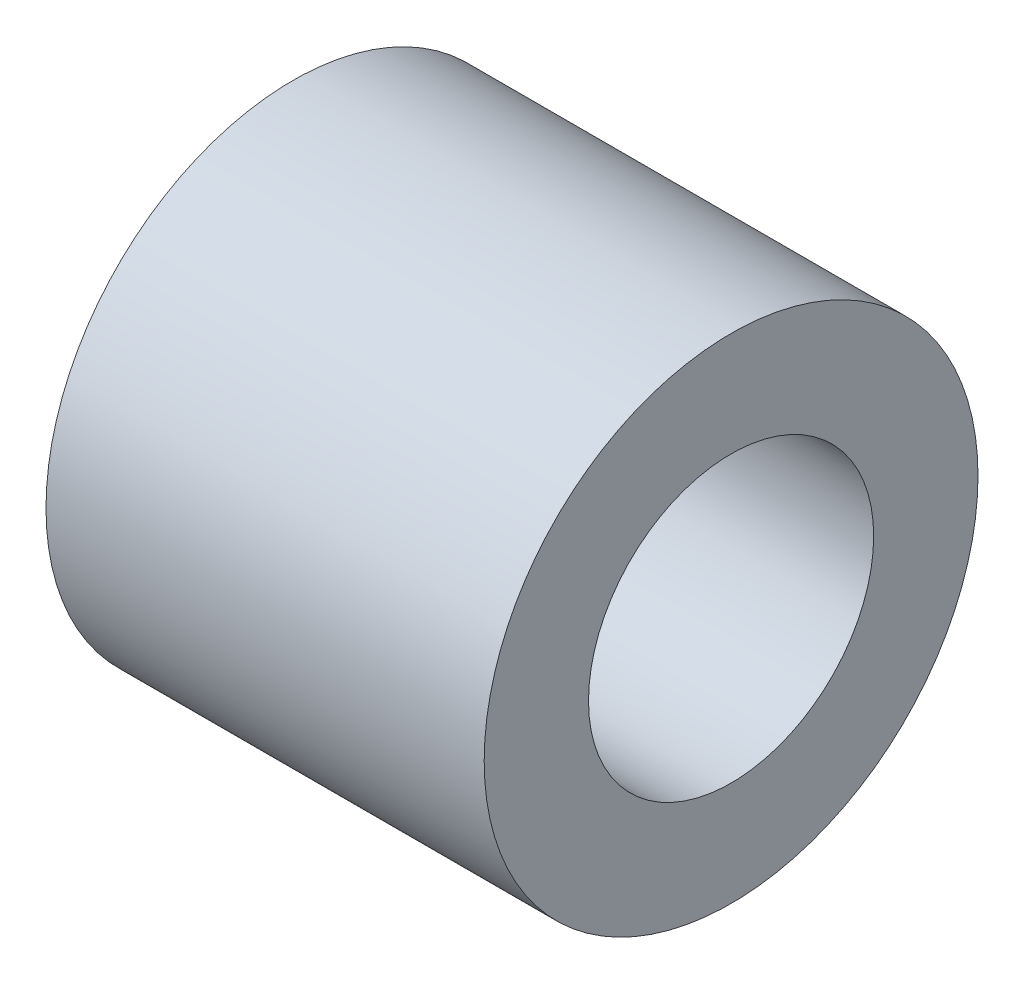
ISO-10303-21;
HEADER;
FILE_DESCRIPTION(('STEP AP214'),'2;1');
FILE_NAME('part.step','',(''),(''),'','','');
FILE_SCHEMA(('AUTOMOTIVE_DESIGN { 1 0 10303 214 1 1 1 1 }'));
ENDSEC;
DATA;
#1=APPLICATION_CONTEXT('core data for automotive mechanical design processes');
#2=APPLICATION_PROTOCOL_DEFINITION('international standard','automotive_design',2000,#1);
#3=PRODUCT_CONTEXT('',#1,'mechanical');
#4=PRODUCT('Part','Part','',(#3));
#5=PRODUCT_RELATED_PRODUCT_CATEGORY('part','',(#4));
#6=PRODUCT_DEFINITION_FORMATION('','',#4);
#7=PRODUCT_DEFINITION_CONTEXT('part definition',#1,'design');
#8=PRODUCT_DEFINITION('design','',#6,#7);
#9=PRODUCT_DEFINITION_SHAPE('','',#8);
#10=(LENGTH_UNIT() NAMED_UNIT(*) SI_UNIT(.MILLI.,.METRE.));
#11=(NAMED_UNIT(*) PLANE_ANGLE_UNIT() SI_UNIT($,.RADIAN.));
#12=(NAMED_UNIT(*) SI_UNIT($,.STERADIAN.) SOLID_ANGLE_UNIT());
#13=UNCERTAINTY_MEASURE_WITH_UNIT(LENGTH_MEASURE(1.E-05),#10,'distance_accuracy_value','');
#14=(GEOMETRIC_REPRESENTATION_CONTEXT(3) GLOBAL_UNCERTAINTY_ASSIGNED_CONTEXT((#13)) GLOBAL_UNIT_ASSIGNED_CONTEXT((#10,
#11,#12)) REPRESENTATION_CONTEXT('',''));
#15=CARTESIAN_POINT('',(0.,0.,0.));
#16=DIRECTION('',(0.,0.,1.));
#17=DIRECTION('',(1.,0.,0.));
#18=AXIS2_PLACEMENT_3D('',#15,#16,#17);
#19=CARTESIAN_POINT('',(12.6,0.,0.));
#20=DIRECTION('',(-1.,0.,0.));
#21=DIRECTION('',(0.,0.,1.));
#22=AXIS2_PLACEMENT_3D('',#19,#20,#21);
#23=PLANE('',#22);
#24=CARTESIAN_POINT('',(12.6,0.,0.));
#25=DIRECTION('',(-1.,0.,0.));
#26=DIRECTION('',(0.,0.,1.));
#27=AXIS2_PLACEMENT_3D('',#24,#25,#26);
#28=CIRCLE('',#27,7.1);
#29=CARTESIAN_POINT('',(12.6,0.,7.1));
#30=VERTEX_POINT('',#29);
#31=EDGE_CURVE('E56',#30,#30,#28,.T.);
#32=ORIENTED_EDGE('',*,*,#31,.F.);
#33=EDGE_LOOP('',(#32));
#34=FACE_BOUND('',#33,.T.);
#35=CARTESIAN_POINT('',(12.6,0.,0.));
#36=DIRECTION('',(-1.,0.,0.));
#37=DIRECTION('',(0.,0.,1.));
#38=AXIS2_PLACEMENT_3D('',#35,#36,#37);
#39=CIRCLE('',#38,4.1);
#40=CARTESIAN_POINT('',(12.6,0.,4.1));
#41=VERTEX_POINT('',#40);
#42=EDGE_CURVE('E10',#41,#41,#39,.T.);
#43=ORIENTED_EDGE('',*,*,#42,.T.);
#44=EDGE_LOOP('',(#43));
#45=FACE_BOUND('',#44,.T.);
#46=ADVANCED_FACE('F39',(#34,#45),#23,.F.);
#47=CARTESIAN_POINT('',(0.,0.,0.));
#48=DIRECTION('',(-1.,0.,0.));
#49=DIRECTION('',(0.,0.,1.));
#50=AXIS2_PLACEMENT_3D('',#47,#48,#49);
#51=CYLINDRICAL_SURFACE('',#50,4.1);
#52=ORIENTED_EDGE('',*,*,#42,.F.);
#53=EDGE_LOOP('',(#52));
#54=FACE_BOUND('',#53,.T.);
#55=CARTESIAN_POINT('',(0.,0.,0.));
#56=DIRECTION('',(-1.,0.,0.));
#57=DIRECTION('',(0.,0.,1.));
#58=AXIS2_PLACEMENT_3D('',#55,#56,#57);
#59=CIRCLE('',#58,4.1);
#60=CARTESIAN_POINT('',(0.,0.,4.1));
#61=VERTEX_POINT('',#60);
#62=EDGE_CURVE('E46',#61,#61,#59,.T.);
#63=ORIENTED_EDGE('',*,*,#62,.T.);
#64=EDGE_LOOP('',(#63));
#65=FACE_BOUND('',#64,.T.);
#66=ADVANCED_FACE('F67',(#54,#65),#51,.F.);
#67=CARTESIAN_POINT('',(0.,0.,0.));
#68=DIRECTION('',(-1.,0.,0.));
#69=DIRECTION('',(0.,0.,1.));
#70=AXIS2_PLACEMENT_3D('',#67,#68,#69);
#71=PLANE('',#70);
#72=CARTESIAN_POINT('',(0.,0.,0.));
#73=DIRECTION('',(-1.,0.,0.));
#74=DIRECTION('',(0.,0.,1.));
#75=AXIS2_PLACEMENT_3D('',#72,#73,#74);
#76=CIRCLE('',#75,7.1);
#77=CARTESIAN_POINT('',(0.,0.,7.1));
#78=VERTEX_POINT('',#77);
#79=EDGE_CURVE('E51',#78,#78,#76,.T.);
#80=ORIENTED_EDGE('',*,*,#79,.T.);
#81=EDGE_LOOP('',(#80));
#82=FACE_BOUND('',#81,.T.);
#83=ORIENTED_EDGE('',*,*,#62,.F.);
#84=EDGE_LOOP('',(#83));
#85=FACE_BOUND('',#84,.T.);
#86=ADVANCED_FACE('F71',(#82,#85),#71,.T.);
#87=CARTESIAN_POINT('',(0.,0.,0.));
#88=DIRECTION('',(-1.,0.,0.));
#89=DIRECTION('',(0.,0.,1.));
#90=AXIS2_PLACEMENT_3D('',#87,#88,#89);
#91=CYLINDRICAL_SURFACE('',#90,7.1);
#92=ORIENTED_EDGE('',*,*,#31,.T.);
#93=EDGE_LOOP('',(#92));
#94=FACE_BOUND('',#93,.T.);
#95=ORIENTED_EDGE('',*,*,#79,.F.);
#96=EDGE_LOOP('',(#95));
#97=FACE_BOUND('',#96,.T.);
#98=ADVANCED_FACE('F63',(#94,#97),#91,.T.);
#99=CLOSED_SHELL('',(#46,#66,#86,#98));
#100=MANIFOLD_SOLID_BREP('B2',#99);
#101=ADVANCED_BREP_SHAPE_REPRESENTATION('',(#18,#100),#14);
#102=SHAPE_DEFINITION_REPRESENTATION(#9,#101);
ENDSEC;
END-ISO-10303-21;
